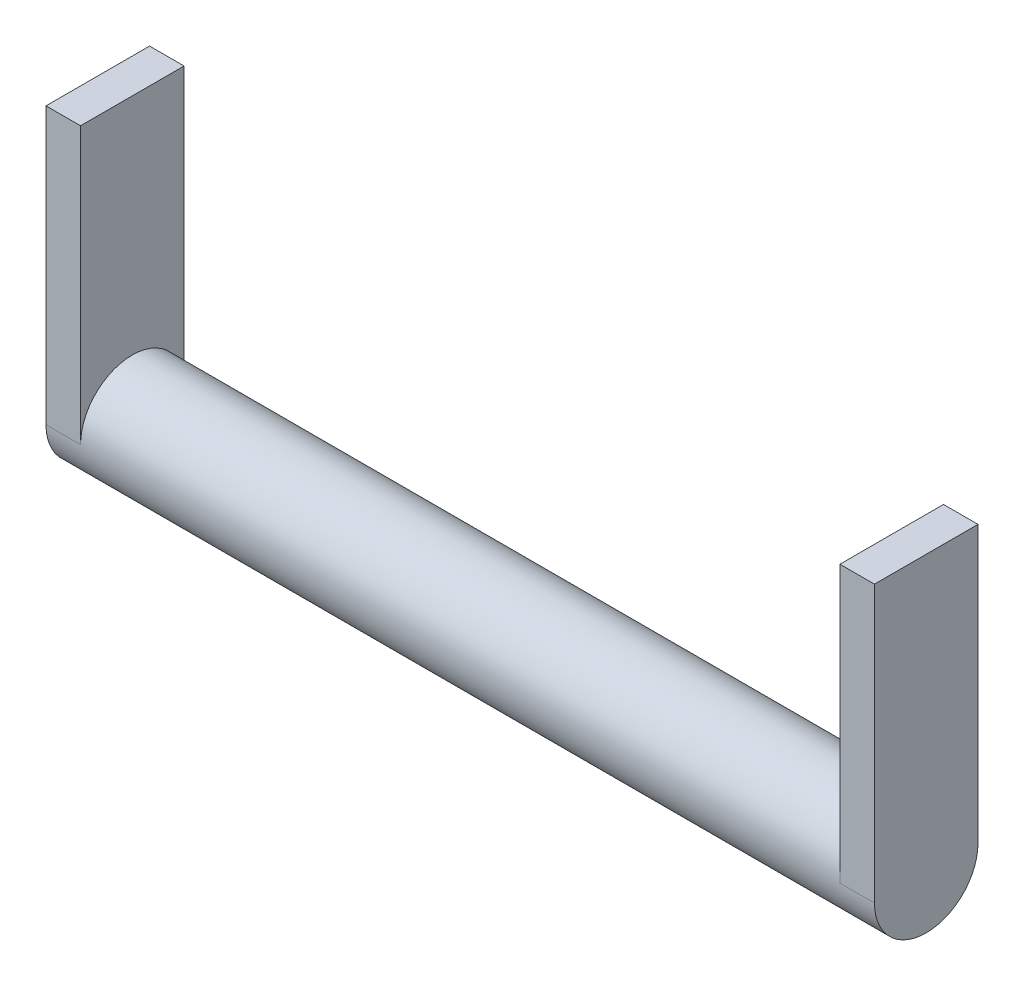
ISO-10303-21;
HEADER;
FILE_DESCRIPTION(('STEP AP214'),'2;1');
FILE_NAME('part.step','',(''),(''),'','','');
FILE_SCHEMA(('AUTOMOTIVE_DESIGN { 1 0 10303 214 1 1 1 1 }'));
ENDSEC;
DATA;
#1=APPLICATION_CONTEXT('core data for automotive mechanical design processes');
#2=APPLICATION_PROTOCOL_DEFINITION('international standard','automotive_design',2000,#1);
#3=PRODUCT_CONTEXT('',#1,'mechanical');
#4=PRODUCT('Part','Part','',(#3));
#5=PRODUCT_RELATED_PRODUCT_CATEGORY('part','',(#4));
#6=PRODUCT_DEFINITION_FORMATION('','',#4);
#7=PRODUCT_DEFINITION_CONTEXT('part definition',#1,'design');
#8=PRODUCT_DEFINITION('design','',#6,#7);
#9=PRODUCT_DEFINITION_SHAPE('','',#8);
#10=(LENGTH_UNIT() NAMED_UNIT(*) SI_UNIT(.MILLI.,.METRE.));
#11=(NAMED_UNIT(*) PLANE_ANGLE_UNIT() SI_UNIT($,.RADIAN.));
#12=(NAMED_UNIT(*) SI_UNIT($,.STERADIAN.) SOLID_ANGLE_UNIT());
#13=UNCERTAINTY_MEASURE_WITH_UNIT(LENGTH_MEASURE(1.E-05),#10,'distance_accuracy_value','');
#14=(GEOMETRIC_REPRESENTATION_CONTEXT(3) GLOBAL_UNCERTAINTY_ASSIGNED_CONTEXT((#13)) GLOBAL_UNIT_ASSIGNED_CONTEXT((#10,
#11,#12)) REPRESENTATION_CONTEXT('',''));
#15=CARTESIAN_POINT('',(0.,0.,0.));
#16=DIRECTION('',(0.,0.,1.));
#17=DIRECTION('',(1.,0.,0.));
#18=AXIS2_PLACEMENT_3D('',#15,#16,#17);
#19=CARTESIAN_POINT('',(279.4,0.,0.));
#20=DIRECTION('',(-1.,0.,0.));
#21=DIRECTION('',(0.,0.,1.));
#22=AXIS2_PLACEMENT_3D('',#19,#20,#21);
#23=CYLINDRICAL_SURFACE('',#22,38.1);
#24=CARTESIAN_POINT('',(279.4,0.,0.));
#25=DIRECTION('',(1.,0.,0.));
#26=DIRECTION('',(0.,0.,-1.));
#27=AXIS2_PLACEMENT_3D('',#24,#25,#26);
#28=CIRCLE('',#27,38.1);
#29=CARTESIAN_POINT('',(279.4,0.,-38.1));
#30=VERTEX_POINT('',#29);
#31=CARTESIAN_POINT('',(279.4,0.,38.1));
#32=VERTEX_POINT('',#31);
#33=EDGE_CURVE('E11',#30,#32,#28,.T.);
#34=ORIENTED_EDGE('',*,*,#33,.F.);
#35=DIRECTION('',(-1.,0.,0.));
#36=VECTOR('',#35,1.);
#37=CARTESIAN_POINT('',(304.8,0.,-38.1));
#38=LINE('',#37,#36);
#39=CARTESIAN_POINT('',(304.8,0.,-38.1));
#40=VERTEX_POINT('',#39);
#41=EDGE_CURVE('E46',#40,#30,#38,.T.);
#42=ORIENTED_EDGE('',*,*,#41,.F.);
#43=CARTESIAN_POINT('',(304.8,0.,0.));
#44=DIRECTION('',(1.,0.,0.));
#45=DIRECTION('',(0.,0.,1.));
#46=AXIS2_PLACEMENT_3D('',#43,#44,#45);
#47=CIRCLE('',#46,38.1);
#48=CARTESIAN_POINT('',(304.8,0.,38.1));
#49=VERTEX_POINT('',#48);
#50=EDGE_CURVE('E142',#49,#40,#47,.T.);
#51=ORIENTED_EDGE('',*,*,#50,.F.);
#52=DIRECTION('',(-1.,0.,0.));
#53=VECTOR('',#52,1.);
#54=CARTESIAN_POINT('',(304.8,0.,38.1));
#55=LINE('',#54,#53);
#56=EDGE_CURVE('E152',#49,#32,#55,.T.);
#57=ORIENTED_EDGE('',*,*,#56,.T.);
#58=EDGE_LOOP('',(#34,#42,#51,#57));
#59=FACE_BOUND('',#58,.T.);
#60=CARTESIAN_POINT('',(-279.4,0.,0.));
#61=DIRECTION('',(1.,0.,0.));
#62=DIRECTION('',(0.,0.,-1.));
#63=AXIS2_PLACEMENT_3D('',#60,#61,#62);
#64=CIRCLE('',#63,38.1);
#65=CARTESIAN_POINT('',(-279.4,0.,-38.1));
#66=VERTEX_POINT('',#65);
#67=CARTESIAN_POINT('',(-279.4,0.,38.1));
#68=VERTEX_POINT('',#67);
#69=EDGE_CURVE('E107',#66,#68,#64,.T.);
#70=ORIENTED_EDGE('',*,*,#69,.T.);
#71=DIRECTION('',(1.,0.,0.));
#72=VECTOR('',#71,1.);
#73=CARTESIAN_POINT('',(-304.8,0.,38.1));
#74=LINE('',#73,#72);
#75=CARTESIAN_POINT('',(-304.8,0.,38.1));
#76=VERTEX_POINT('',#75);
#77=EDGE_CURVE('E102',#76,#68,#74,.T.);
#78=ORIENTED_EDGE('',*,*,#77,.F.);
#79=CARTESIAN_POINT('',(-304.8,0.,0.));
#80=DIRECTION('',(1.,0.,0.));
#81=DIRECTION('',(0.,0.,1.));
#82=AXIS2_PLACEMENT_3D('',#79,#80,#81);
#83=CIRCLE('',#82,38.1);
#84=CARTESIAN_POINT('',(-304.8,0.,-38.1));
#85=VERTEX_POINT('',#84);
#86=EDGE_CURVE('E104',#76,#85,#83,.T.);
#87=ORIENTED_EDGE('',*,*,#86,.T.);
#88=DIRECTION('',(1.,0.,0.));
#89=VECTOR('',#88,1.);
#90=CARTESIAN_POINT('',(-304.8,0.,-38.1));
#91=LINE('',#90,#89);
#92=EDGE_CURVE('E129',#85,#66,#91,.T.);
#93=ORIENTED_EDGE('',*,*,#92,.T.);
#94=EDGE_LOOP('',(#70,#78,#87,#93));
#95=FACE_BOUND('',#94,.T.);
#96=ADVANCED_FACE('F39',(#59,#95),#23,.T.);
#97=CARTESIAN_POINT('',(304.8,203.2,-38.1));
#98=DIRECTION('',(0.,0.,1.));
#99=DIRECTION('',(1.,0.,0.));
#100=AXIS2_PLACEMENT_3D('',#97,#98,#99);
#101=PLANE('',#100);
#102=DIRECTION('',(0.,1.,0.));
#103=VECTOR('',#102,1.);
#104=CARTESIAN_POINT('',(279.4,203.2,-38.1));
#105=LINE('',#104,#103);
#106=CARTESIAN_POINT('',(279.4,203.2,-38.1));
#107=VERTEX_POINT('',#106);
#108=EDGE_CURVE('E141',#30,#107,#105,.T.);
#109=ORIENTED_EDGE('',*,*,#108,.T.);
#110=DIRECTION('',(-1.,0.,0.));
#111=VECTOR('',#110,1.);
#112=CARTESIAN_POINT('',(304.8,203.2,-38.1));
#113=LINE('',#112,#111);
#114=CARTESIAN_POINT('',(304.8,203.2,-38.1));
#115=VERTEX_POINT('',#114);
#116=EDGE_CURVE('E162',#115,#107,#113,.T.);
#117=ORIENTED_EDGE('',*,*,#116,.F.);
#118=DIRECTION('',(0.,1.,0.));
#119=VECTOR('',#118,1.);
#120=CARTESIAN_POINT('',(304.8,203.2,-38.1));
#121=LINE('',#120,#119);
#122=EDGE_CURVE('E145',#40,#115,#121,.T.);
#123=ORIENTED_EDGE('',*,*,#122,.F.);
#124=ORIENTED_EDGE('',*,*,#41,.T.);
#125=EDGE_LOOP('',(#109,#117,#123,#124));
#126=FACE_BOUND('',#125,.T.);
#127=ADVANCED_FACE('F167',(#126),#101,.F.);
#128=CARTESIAN_POINT('',(304.8,203.2,38.1));
#129=DIRECTION('',(0.,-1.,0.));
#130=DIRECTION('',(0.,0.,-1.));
#131=AXIS2_PLACEMENT_3D('',#128,#129,#130);
#132=PLANE('',#131);
#133=DIRECTION('',(0.,0.,1.));
#134=VECTOR('',#133,1.);
#135=CARTESIAN_POINT('',(279.4,203.2,38.1));
#136=LINE('',#135,#134);
#137=CARTESIAN_POINT('',(279.4,203.2,38.1));
#138=VERTEX_POINT('',#137);
#139=EDGE_CURVE('E154',#107,#138,#136,.T.);
#140=ORIENTED_EDGE('',*,*,#139,.T.);
#141=DIRECTION('',(-1.,0.,0.));
#142=VECTOR('',#141,1.);
#143=CARTESIAN_POINT('',(304.8,203.2,38.1));
#144=LINE('',#143,#142);
#145=CARTESIAN_POINT('',(304.8,203.2,38.1));
#146=VERTEX_POINT('',#145);
#147=EDGE_CURVE('E159',#146,#138,#144,.T.);
#148=ORIENTED_EDGE('',*,*,#147,.F.);
#149=DIRECTION('',(0.,0.,1.));
#150=VECTOR('',#149,1.);
#151=CARTESIAN_POINT('',(304.8,203.2,38.1));
#152=LINE('',#151,#150);
#153=EDGE_CURVE('E148',#115,#146,#152,.T.);
#154=ORIENTED_EDGE('',*,*,#153,.F.);
#155=ORIENTED_EDGE('',*,*,#116,.T.);
#156=EDGE_LOOP('',(#140,#148,#154,#155));
#157=FACE_BOUND('',#156,.T.);
#158=ADVANCED_FACE('F176',(#157),#132,.F.);
#159=CARTESIAN_POINT('',(304.8,0.,38.1));
#160=DIRECTION('',(0.,0.,-1.));
#161=DIRECTION('',(-1.,0.,0.));
#162=AXIS2_PLACEMENT_3D('',#159,#160,#161);
#163=PLANE('',#162);
#164=DIRECTION('',(0.,-1.,0.));
#165=VECTOR('',#164,1.);
#166=CARTESIAN_POINT('',(279.4,0.,38.1));
#167=LINE('',#166,#165);
#168=EDGE_CURVE('E146',#138,#32,#167,.T.);
#169=ORIENTED_EDGE('',*,*,#168,.T.);
#170=ORIENTED_EDGE('',*,*,#56,.F.);
#171=DIRECTION('',(0.,-1.,0.));
#172=VECTOR('',#171,1.);
#173=CARTESIAN_POINT('',(304.8,0.,38.1));
#174=LINE('',#173,#172);
#175=EDGE_CURVE('E150',#146,#49,#174,.T.);
#176=ORIENTED_EDGE('',*,*,#175,.F.);
#177=ORIENTED_EDGE('',*,*,#147,.T.);
#178=EDGE_LOOP('',(#169,#170,#176,#177));
#179=FACE_BOUND('',#178,.T.);
#180=ADVANCED_FACE('F180',(#179),#163,.F.);
#181=CARTESIAN_POINT('',(304.8,0.,0.));
#182=DIRECTION('',(-1.,0.,0.));
#183=DIRECTION('',(0.,0.,1.));
#184=AXIS2_PLACEMENT_3D('',#181,#182,#183);
#185=PLANE('',#184);
#186=ORIENTED_EDGE('',*,*,#50,.T.);
#187=ORIENTED_EDGE('',*,*,#122,.T.);
#188=ORIENTED_EDGE('',*,*,#153,.T.);
#189=ORIENTED_EDGE('',*,*,#175,.T.);
#190=EDGE_LOOP('',(#186,#187,#188,#189));
#191=FACE_BOUND('',#190,.T.);
#192=ADVANCED_FACE('F182',(#191),#185,.F.);
#193=CARTESIAN_POINT('',(279.4,0.,0.));
#194=DIRECTION('',(-1.,0.,0.));
#195=DIRECTION('',(0.,0.,1.));
#196=AXIS2_PLACEMENT_3D('',#193,#194,#195);
#197=PLANE('',#196);
#198=ORIENTED_EDGE('',*,*,#108,.F.);
#199=ORIENTED_EDGE('',*,*,#33,.T.);
#200=ORIENTED_EDGE('',*,*,#168,.F.);
#201=ORIENTED_EDGE('',*,*,#139,.F.);
#202=EDGE_LOOP('',(#198,#199,#200,#201));
#203=FACE_BOUND('',#202,.T.);
#204=ADVANCED_FACE('F173',(#203),#197,.T.);
#205=CARTESIAN_POINT('',(-279.4,0.,0.));
#206=DIRECTION('',(1.,0.,0.));
#207=DIRECTION('',(0.,0.,1.));
#208=AXIS2_PLACEMENT_3D('',#205,#206,#207);
#209=PLANE('',#208);
#210=ORIENTED_EDGE('',*,*,#69,.F.);
#211=DIRECTION('',(0.,1.,0.));
#212=VECTOR('',#211,1.);
#213=CARTESIAN_POINT('',(-279.4,203.2,-38.1));
#214=LINE('',#213,#212);
#215=CARTESIAN_POINT('',(-279.4,203.2,-38.1));
#216=VERTEX_POINT('',#215);
#217=EDGE_CURVE('E53',#66,#216,#214,.T.);
#218=ORIENTED_EDGE('',*,*,#217,.T.);
#219=DIRECTION('',(0.,0.,1.));
#220=VECTOR('',#219,1.);
#221=CARTESIAN_POINT('',(-279.4,203.2,38.1));
#222=LINE('',#221,#220);
#223=CARTESIAN_POINT('',(-279.4,203.2,38.1));
#224=VERTEX_POINT('',#223);
#225=EDGE_CURVE('E132',#216,#224,#222,.T.);
#226=ORIENTED_EDGE('',*,*,#225,.T.);
#227=DIRECTION('',(0.,-1.,0.));
#228=VECTOR('',#227,1.);
#229=CARTESIAN_POINT('',(-279.4,0.,38.1));
#230=LINE('',#229,#228);
#231=EDGE_CURVE('E130',#224,#68,#230,.T.);
#232=ORIENTED_EDGE('',*,*,#231,.T.);
#233=EDGE_LOOP('',(#210,#218,#226,#232));
#234=FACE_BOUND('',#233,.T.);
#235=ADVANCED_FACE('F189',(#234),#209,.T.);
#236=CARTESIAN_POINT('',(-304.8,0.,38.1));
#237=DIRECTION('',(0.,0.,1.));
#238=DIRECTION('',(1.,0.,0.));
#239=AXIS2_PLACEMENT_3D('',#236,#237,#238);
#240=PLANE('',#239);
#241=ORIENTED_EDGE('',*,*,#231,.F.);
#242=DIRECTION('',(1.,0.,0.));
#243=VECTOR('',#242,1.);
#244=CARTESIAN_POINT('',(-304.8,203.2,38.1));
#245=LINE('',#244,#243);
#246=CARTESIAN_POINT('',(-304.8,203.2,38.1));
#247=VERTEX_POINT('',#246);
#248=EDGE_CURVE('E112',#247,#224,#245,.T.);
#249=ORIENTED_EDGE('',*,*,#248,.F.);
#250=DIRECTION('',(0.,-1.,0.));
#251=VECTOR('',#250,1.);
#252=CARTESIAN_POINT('',(-304.8,0.,38.1));
#253=LINE('',#252,#251);
#254=EDGE_CURVE('E118',#247,#76,#253,.T.);
#255=ORIENTED_EDGE('',*,*,#254,.T.);
#256=ORIENTED_EDGE('',*,*,#77,.T.);
#257=EDGE_LOOP('',(#241,#249,#255,#256));
#258=FACE_BOUND('',#257,.T.);
#259=ADVANCED_FACE('F123',(#258),#240,.T.);
#260=CARTESIAN_POINT('',(-304.8,203.2,38.1));
#261=DIRECTION('',(0.,1.,0.));
#262=DIRECTION('',(0.,0.,1.));
#263=AXIS2_PLACEMENT_3D('',#260,#261,#262);
#264=PLANE('',#263);
#265=ORIENTED_EDGE('',*,*,#225,.F.);
#266=DIRECTION('',(1.,0.,0.));
#267=VECTOR('',#266,1.);
#268=CARTESIAN_POINT('',(-304.8,203.2,-38.1));
#269=LINE('',#268,#267);
#270=CARTESIAN_POINT('',(-304.8,203.2,-38.1));
#271=VERTEX_POINT('',#270);
#272=EDGE_CURVE('E137',#271,#216,#269,.T.);
#273=ORIENTED_EDGE('',*,*,#272,.F.);
#274=DIRECTION('',(0.,0.,1.));
#275=VECTOR('',#274,1.);
#276=CARTESIAN_POINT('',(-304.8,203.2,38.1));
#277=LINE('',#276,#275);
#278=EDGE_CURVE('E124',#271,#247,#277,.T.);
#279=ORIENTED_EDGE('',*,*,#278,.T.);
#280=ORIENTED_EDGE('',*,*,#248,.T.);
#281=EDGE_LOOP('',(#265,#273,#279,#280));
#282=FACE_BOUND('',#281,.T.);
#283=ADVANCED_FACE('F246',(#282),#264,.T.);
#284=CARTESIAN_POINT('',(-304.8,203.2,-38.1));
#285=DIRECTION('',(0.,0.,-1.));
#286=DIRECTION('',(-1.,0.,0.));
#287=AXIS2_PLACEMENT_3D('',#284,#285,#286);
#288=PLANE('',#287);
#289=ORIENTED_EDGE('',*,*,#217,.F.);
#290=ORIENTED_EDGE('',*,*,#92,.F.);
#291=DIRECTION('',(0.,1.,0.));
#292=VECTOR('',#291,1.);
#293=CARTESIAN_POINT('',(-304.8,203.2,-38.1));
#294=LINE('',#293,#292);
#295=EDGE_CURVE('E121',#85,#271,#294,.T.);
#296=ORIENTED_EDGE('',*,*,#295,.T.);
#297=ORIENTED_EDGE('',*,*,#272,.T.);
#298=EDGE_LOOP('',(#289,#290,#296,#297));
#299=FACE_BOUND('',#298,.T.);
#300=ADVANCED_FACE('F254',(#299),#288,.T.);
#301=CARTESIAN_POINT('',(-304.8,0.,0.));
#302=DIRECTION('',(1.,0.,0.));
#303=DIRECTION('',(0.,0.,1.));
#304=AXIS2_PLACEMENT_3D('',#301,#302,#303);
#305=PLANE('',#304);
#306=ORIENTED_EDGE('',*,*,#86,.F.);
#307=ORIENTED_EDGE('',*,*,#254,.F.);
#308=ORIENTED_EDGE('',*,*,#278,.F.);
#309=ORIENTED_EDGE('',*,*,#295,.F.);
#310=EDGE_LOOP('',(#306,#307,#308,#309));
#311=FACE_BOUND('',#310,.T.);
#312=ADVANCED_FACE('F116',(#311),#305,.F.);
#313=CLOSED_SHELL('',(#96,#127,#158,#180,#192,#204,#235,#259,#283,#300,#312));
#314=MANIFOLD_SOLID_BREP('B2',#313);
#315=ADVANCED_BREP_SHAPE_REPRESENTATION('',(#18,#314),#14);
#316=SHAPE_DEFINITION_REPRESENTATION(#9,#315);
ENDSEC;
END-ISO-10303-21;
